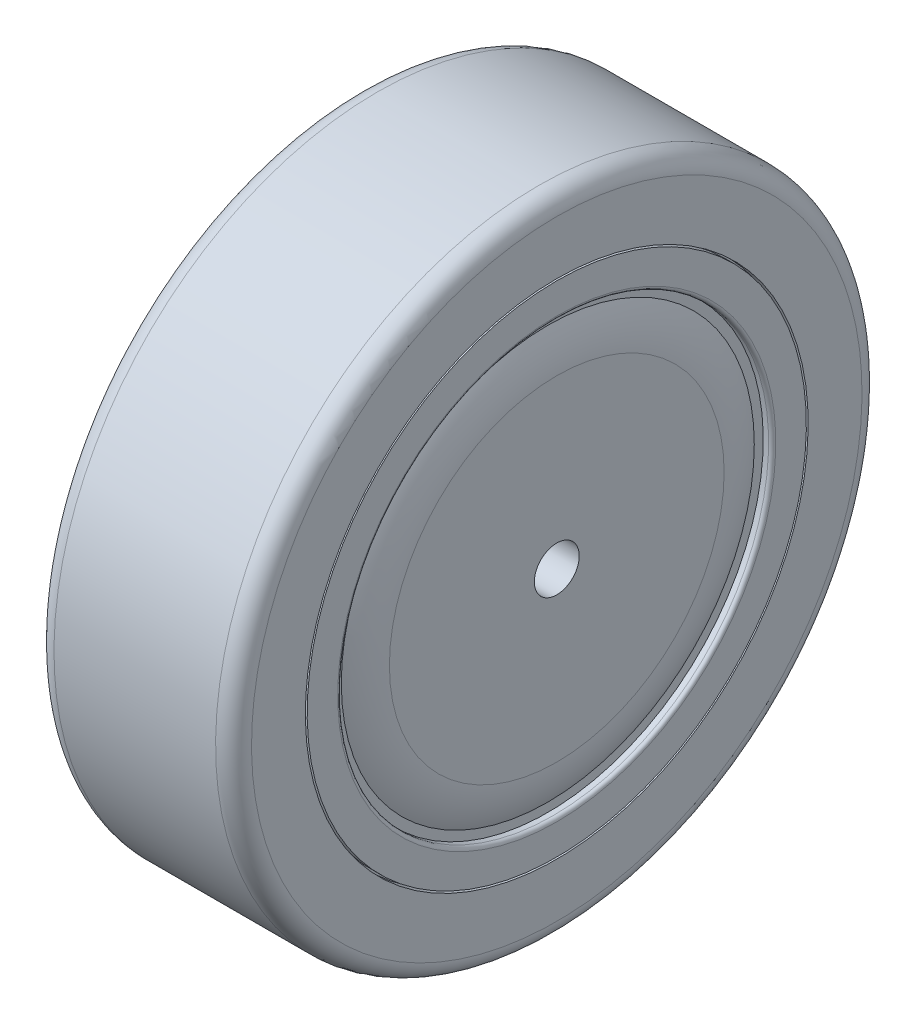
ISO-10303-21;
HEADER;
FILE_DESCRIPTION(('STEP AP214'),'2;1');
FILE_NAME('part.step','',(''),(''),'','','');
FILE_SCHEMA(('AUTOMOTIVE_DESIGN { 1 0 10303 214 1 1 1 1 }'));
ENDSEC;
DATA;
#1=APPLICATION_CONTEXT('core data for automotive mechanical design processes');
#2=APPLICATION_PROTOCOL_DEFINITION('international standard','automotive_design',2000,#1);
#3=PRODUCT_CONTEXT('',#1,'mechanical');
#4=PRODUCT('Part','Part','',(#3));
#5=PRODUCT_RELATED_PRODUCT_CATEGORY('part','',(#4));
#6=PRODUCT_DEFINITION_FORMATION('','',#4);
#7=PRODUCT_DEFINITION_CONTEXT('part definition',#1,'design');
#8=PRODUCT_DEFINITION('design','',#6,#7);
#9=PRODUCT_DEFINITION_SHAPE('','',#8);
#10=(LENGTH_UNIT() NAMED_UNIT(*) SI_UNIT(.MILLI.,.METRE.));
#11=(NAMED_UNIT(*) PLANE_ANGLE_UNIT() SI_UNIT($,.RADIAN.));
#12=(NAMED_UNIT(*) SI_UNIT($,.STERADIAN.) SOLID_ANGLE_UNIT());
#13=UNCERTAINTY_MEASURE_WITH_UNIT(LENGTH_MEASURE(1.E-05),#10,'distance_accuracy_value','');
#14=(GEOMETRIC_REPRESENTATION_CONTEXT(3) GLOBAL_UNCERTAINTY_ASSIGNED_CONTEXT((#13)) GLOBAL_UNIT_ASSIGNED_CONTEXT((#10,
#11,#12)) REPRESENTATION_CONTEXT('',''));
#15=CARTESIAN_POINT('',(0.,0.,0.));
#16=DIRECTION('',(0.,0.,1.));
#17=DIRECTION('',(1.,0.,0.));
#18=AXIS2_PLACEMENT_3D('',#15,#16,#17);
#19=CARTESIAN_POINT('',(11.,-23.,0.));
#20=DIRECTION('',(-1.,0.,0.));
#21=DIRECTION('',(0.,-1.,0.));
#22=AXIS2_PLACEMENT_3D('',#19,#20,#21);
#23=PLANE('',#22);
#24=CARTESIAN_POINT('',(11.,0.,0.));
#25=DIRECTION('',(-1.,0.,0.));
#26=DIRECTION('',(0.,-1.,0.));
#27=AXIS2_PLACEMENT_3D('',#24,#25,#26);
#28=CIRCLE('',#27,18.6411010564593);
#29=CARTESIAN_POINT('',(11.,-18.6411010564593,0.));
#30=VERTEX_POINT('',#29);
#31=EDGE_CURVE('E67',#30,#30,#28,.F.);
#32=ORIENTED_EDGE('',*,*,#31,.T.);
#33=EDGE_LOOP('',(#32));
#34=FACE_BOUND('',#33,.T.);
#35=CARTESIAN_POINT('',(11.,0.,0.));
#36=DIRECTION('',(-1.,0.,0.));
#37=DIRECTION('',(0.,0.,1.));
#38=AXIS2_PLACEMENT_3D('',#35,#36,#37);
#39=CIRCLE('',#38,2.5);
#40=CARTESIAN_POINT('',(11.,0.,2.5));
#41=VERTEX_POINT('',#40);
#42=EDGE_CURVE('E135',#41,#41,#39,.T.);
#43=ORIENTED_EDGE('',*,*,#42,.T.);
#44=EDGE_LOOP('',(#43));
#45=FACE_BOUND('',#44,.T.);
#46=ADVANCED_FACE('F39',(#34,#45),#23,.F.);
#47=CARTESIAN_POINT('',(-11.,-23.,0.));
#48=DIRECTION('',(1.,0.,0.));
#49=DIRECTION('',(0.,1.,0.));
#50=AXIS2_PLACEMENT_3D('',#47,#48,#49);
#51=PLANE('',#50);
#52=CARTESIAN_POINT('',(-11.,0.,0.));
#53=DIRECTION('',(1.,0.,0.));
#54=DIRECTION('',(0.,1.,0.));
#55=AXIS2_PLACEMENT_3D('',#52,#53,#54);
#56=CIRCLE('',#55,18.6411010564593);
#57=CARTESIAN_POINT('',(-11.,18.6411010564593,0.));
#58=VERTEX_POINT('',#57);
#59=EDGE_CURVE('E63',#58,#58,#56,.F.);
#60=ORIENTED_EDGE('',*,*,#59,.T.);
#61=EDGE_LOOP('',(#60));
#62=FACE_BOUND('',#61,.T.);
#63=CARTESIAN_POINT('',(-11.,0.,0.));
#64=DIRECTION('',(-1.,0.,0.));
#65=DIRECTION('',(0.,0.,1.));
#66=AXIS2_PLACEMENT_3D('',#63,#64,#65);
#67=CIRCLE('',#66,2.5);
#68=CARTESIAN_POINT('',(-11.,0.,2.5));
#69=VERTEX_POINT('',#68);
#70=EDGE_CURVE('E139',#69,#69,#67,.T.);
#71=ORIENTED_EDGE('',*,*,#70,.F.);
#72=EDGE_LOOP('',(#71));
#73=FACE_BOUND('',#72,.T.);
#74=ADVANCED_FACE('F146',(#62,#73),#51,.F.);
#75=CARTESIAN_POINT('',(-9.99999999999999,-24.,0.));
#76=DIRECTION('',(1.,0.,0.));
#77=DIRECTION('',(0.,1.,0.));
#78=AXIS2_PLACEMENT_3D('',#75,#76,#77);
#79=PLANE('',#78);
#80=CARTESIAN_POINT('',(-10.,0.,0.));
#81=DIRECTION('',(1.,0.,0.));
#82=DIRECTION('',(0.,1.,0.));
#83=AXIS2_PLACEMENT_3D('',#80,#81,#82);
#84=CIRCLE('',#83,24.);
#85=CARTESIAN_POINT('',(-10.,24.,0.));
#86=VERTEX_POINT('',#85);
#87=EDGE_CURVE('E75',#86,#86,#84,.T.);
#88=ORIENTED_EDGE('',*,*,#87,.F.);
#89=EDGE_LOOP('',(#88));
#90=FACE_BOUND('',#89,.T.);
#91=CARTESIAN_POINT('',(-10.,0.,0.));
#92=DIRECTION('',(1.,0.,0.));
#93=DIRECTION('',(0.,1.,0.));
#94=AXIS2_PLACEMENT_3D('',#91,#92,#93);
#95=CIRCLE('',#94,23.);
#96=CARTESIAN_POINT('',(-10.,23.,0.));
#97=VERTEX_POINT('',#96);
#98=EDGE_CURVE('E71',#97,#97,#95,.T.);
#99=ORIENTED_EDGE('',*,*,#98,.T.);
#100=EDGE_LOOP('',(#99));
#101=FACE_BOUND('',#100,.T.);
#102=ADVANCED_FACE('F148',(#90,#101),#79,.F.);
#103=CARTESIAN_POINT('',(11.,0.,0.));
#104=DIRECTION('',(1.,0.,0.));
#105=DIRECTION('',(0.,1.,0.));
#106=AXIS2_PLACEMENT_3D('',#103,#104,#105);
#107=CYLINDRICAL_SURFACE('',#106,24.);
#108=CARTESIAN_POINT('',(-10.6,0.,0.));
#109=DIRECTION('',(1.,0.,0.));
#110=DIRECTION('',(0.,1.,0.));
#111=AXIS2_PLACEMENT_3D('',#108,#109,#110);
#112=CIRCLE('',#111,24.);
#113=CARTESIAN_POINT('',(-10.6,24.,0.));
#114=VERTEX_POINT('',#113);
#115=EDGE_CURVE('E10',#114,#114,#112,.F.);
#116=ORIENTED_EDGE('',*,*,#115,.T.);
#117=EDGE_LOOP('',(#116));
#118=FACE_BOUND('',#117,.T.);
#119=ORIENTED_EDGE('',*,*,#87,.T.);
#120=EDGE_LOOP('',(#119));
#121=FACE_BOUND('',#120,.T.);
#122=ADVANCED_FACE('F155',(#118,#121),#107,.F.);
#123=CARTESIAN_POINT('',(-11.,-27.8,0.));
#124=DIRECTION('',(1.,0.,0.));
#125=DIRECTION('',(0.,1.,0.));
#126=AXIS2_PLACEMENT_3D('',#123,#124,#125);
#127=PLANE('',#126);
#128=CARTESIAN_POINT('',(-11.,0.,0.));
#129=DIRECTION('',(1.,0.,0.));
#130=DIRECTION('',(0.,1.,0.));
#131=AXIS2_PLACEMENT_3D('',#128,#129,#130);
#132=CIRCLE('',#131,24.4);
#133=CARTESIAN_POINT('',(-11.,24.4,0.));
#134=VERTEX_POINT('',#133);
#135=EDGE_CURVE('E47',#134,#134,#132,.T.);
#136=ORIENTED_EDGE('',*,*,#135,.T.);
#137=EDGE_LOOP('',(#136));
#138=FACE_BOUND('',#137,.T.);
#139=CARTESIAN_POINT('',(-11.,0.,0.));
#140=DIRECTION('',(1.,0.,0.));
#141=DIRECTION('',(0.,1.,0.));
#142=AXIS2_PLACEMENT_3D('',#139,#140,#141);
#143=CIRCLE('',#142,27.8);
#144=CARTESIAN_POINT('',(-11.,27.8,0.));
#145=VERTEX_POINT('',#144);
#146=EDGE_CURVE('E79',#145,#145,#143,.T.);
#147=ORIENTED_EDGE('',*,*,#146,.F.);
#148=EDGE_LOOP('',(#147));
#149=FACE_BOUND('',#148,.T.);
#150=ADVANCED_FACE('F244',(#138,#149),#127,.F.);
#151=CARTESIAN_POINT('',(11.,0.,0.));
#152=DIRECTION('',(1.,0.,0.));
#153=DIRECTION('',(0.,1.,0.));
#154=AXIS2_PLACEMENT_3D('',#151,#152,#153);
#155=CYLINDRICAL_SURFACE('',#154,27.8);
#156=CARTESIAN_POINT('',(-10.,0.,0.));
#157=DIRECTION('',(1.,0.,0.));
#158=DIRECTION('',(0.,1.,0.));
#159=AXIS2_PLACEMENT_3D('',#156,#157,#158);
#160=CIRCLE('',#159,27.8);
#161=CARTESIAN_POINT('',(-10.,27.8,0.));
#162=VERTEX_POINT('',#161);
#163=EDGE_CURVE('E83',#162,#162,#160,.T.);
#164=ORIENTED_EDGE('',*,*,#163,.F.);
#165=EDGE_LOOP('',(#164));
#166=FACE_BOUND('',#165,.T.);
#167=ORIENTED_EDGE('',*,*,#146,.T.);
#168=EDGE_LOOP('',(#167));
#169=FACE_BOUND('',#168,.T.);
#170=ADVANCED_FACE('F240',(#166,#169),#155,.T.);
#171=CARTESIAN_POINT('',(-9.99999999999999,-28.,0.));
#172=DIRECTION('',(1.,0.,0.));
#173=DIRECTION('',(0.,1.,0.));
#174=AXIS2_PLACEMENT_3D('',#171,#172,#173);
#175=PLANE('',#174);
#176=CARTESIAN_POINT('',(-10.,0.,0.));
#177=DIRECTION('',(1.,0.,0.));
#178=DIRECTION('',(0.,1.,0.));
#179=AXIS2_PLACEMENT_3D('',#176,#177,#178);
#180=CIRCLE('',#179,28.);
#181=CARTESIAN_POINT('',(-10.,28.,0.));
#182=VERTEX_POINT('',#181);
#183=EDGE_CURVE('E87',#182,#182,#180,.T.);
#184=ORIENTED_EDGE('',*,*,#183,.F.);
#185=EDGE_LOOP('',(#184));
#186=FACE_BOUND('',#185,.T.);
#187=ORIENTED_EDGE('',*,*,#163,.T.);
#188=EDGE_LOOP('',(#187));
#189=FACE_BOUND('',#188,.T.);
#190=ADVANCED_FACE('F236',(#186,#189),#175,.F.);
#191=CARTESIAN_POINT('',(11.,0.,0.));
#192=DIRECTION('',(1.,0.,0.));
#193=DIRECTION('',(0.,1.,0.));
#194=AXIS2_PLACEMENT_3D('',#191,#192,#193);
#195=CYLINDRICAL_SURFACE('',#194,28.);
#196=CARTESIAN_POINT('',(-11.,0.,0.));
#197=DIRECTION('',(1.,0.,0.));
#198=DIRECTION('',(0.,1.,0.));
#199=AXIS2_PLACEMENT_3D('',#196,#197,#198);
#200=CIRCLE('',#199,28.);
#201=CARTESIAN_POINT('',(-11.,28.,0.));
#202=VERTEX_POINT('',#201);
#203=EDGE_CURVE('E91',#202,#202,#200,.T.);
#204=ORIENTED_EDGE('',*,*,#203,.F.);
#205=EDGE_LOOP('',(#204));
#206=FACE_BOUND('',#205,.T.);
#207=ORIENTED_EDGE('',*,*,#183,.T.);
#208=EDGE_LOOP('',(#207));
#209=FACE_BOUND('',#208,.T.);
#210=ADVANCED_FACE('F232',(#206,#209),#195,.F.);
#211=CARTESIAN_POINT('',(-11.,-34.,0.));
#212=DIRECTION('',(1.,0.,0.));
#213=DIRECTION('',(0.,1.,0.));
#214=AXIS2_PLACEMENT_3D('',#211,#212,#213);
#215=PLANE('',#214);
#216=CARTESIAN_POINT('',(-11.,0.,0.));
#217=DIRECTION('',(1.,0.,0.));
#218=DIRECTION('',(0.,1.,0.));
#219=AXIS2_PLACEMENT_3D('',#216,#217,#218);
#220=CIRCLE('',#219,34.);
#221=CARTESIAN_POINT('',(-11.,34.,0.));
#222=VERTEX_POINT('',#221);
#223=EDGE_CURVE('E95',#222,#222,#220,.T.);
#224=ORIENTED_EDGE('',*,*,#223,.F.);
#225=EDGE_LOOP('',(#224));
#226=FACE_BOUND('',#225,.T.);
#227=ORIENTED_EDGE('',*,*,#203,.T.);
#228=EDGE_LOOP('',(#227));
#229=FACE_BOUND('',#228,.T.);
#230=ADVANCED_FACE('F228',(#226,#229),#215,.F.);
#231=CARTESIAN_POINT('',(-9.,0.,0.));
#232=DIRECTION('',(1.,0.,0.));
#233=DIRECTION('',(0.,1.,0.));
#234=AXIS2_PLACEMENT_3D('',#231,#232,#233);
#235=TOROIDAL_SURFACE('',#234,34.,2.);
#236=CARTESIAN_POINT('',(-9.,0.,0.));
#237=DIRECTION('',(1.,0.,0.));
#238=DIRECTION('',(0.,1.,0.));
#239=AXIS2_PLACEMENT_3D('',#236,#237,#238);
#240=CIRCLE('',#239,36.);
#241=CARTESIAN_POINT('',(-9.,36.,0.));
#242=VERTEX_POINT('',#241);
#243=EDGE_CURVE('E99',#242,#242,#240,.T.);
#244=ORIENTED_EDGE('',*,*,#243,.F.);
#245=EDGE_LOOP('',(#244));
#246=FACE_BOUND('',#245,.T.);
#247=ORIENTED_EDGE('',*,*,#223,.T.);
#248=EDGE_LOOP('',(#247));
#249=FACE_BOUND('',#248,.T.);
#250=ADVANCED_FACE('F224',(#246,#249),#235,.T.);
#251=CARTESIAN_POINT('',(11.,0.,0.));
#252=DIRECTION('',(1.,0.,0.));
#253=DIRECTION('',(0.,1.,0.));
#254=AXIS2_PLACEMENT_3D('',#251,#252,#253);
#255=CYLINDRICAL_SURFACE('',#254,36.);
#256=CARTESIAN_POINT('',(9.,0.,0.));
#257=DIRECTION('',(1.,0.,0.));
#258=DIRECTION('',(0.,1.,0.));
#259=AXIS2_PLACEMENT_3D('',#256,#257,#258);
#260=CIRCLE('',#259,36.);
#261=CARTESIAN_POINT('',(8.99999999999999,36.,0.));
#262=VERTEX_POINT('',#261);
#263=EDGE_CURVE('E103',#262,#262,#260,.T.);
#264=ORIENTED_EDGE('',*,*,#263,.F.);
#265=EDGE_LOOP('',(#264));
#266=FACE_BOUND('',#265,.T.);
#267=ORIENTED_EDGE('',*,*,#243,.T.);
#268=EDGE_LOOP('',(#267));
#269=FACE_BOUND('',#268,.T.);
#270=ADVANCED_FACE('F220',(#266,#269),#255,.T.);
#271=CARTESIAN_POINT('',(9.,0.,0.));
#272=DIRECTION('',(1.,0.,0.));
#273=DIRECTION('',(0.,1.,0.));
#274=AXIS2_PLACEMENT_3D('',#271,#272,#273);
#275=TOROIDAL_SURFACE('',#274,34.,2.);
#276=CARTESIAN_POINT('',(11.,0.,0.));
#277=DIRECTION('',(1.,0.,0.));
#278=DIRECTION('',(0.,1.,0.));
#279=AXIS2_PLACEMENT_3D('',#276,#277,#278);
#280=CIRCLE('',#279,34.);
#281=CARTESIAN_POINT('',(11.,34.,0.));
#282=VERTEX_POINT('',#281);
#283=EDGE_CURVE('E107',#282,#282,#280,.T.);
#284=ORIENTED_EDGE('',*,*,#283,.F.);
#285=EDGE_LOOP('',(#284));
#286=FACE_BOUND('',#285,.T.);
#287=ORIENTED_EDGE('',*,*,#263,.T.);
#288=EDGE_LOOP('',(#287));
#289=FACE_BOUND('',#288,.T.);
#290=ADVANCED_FACE('F216',(#286,#289),#275,.T.);
#291=CARTESIAN_POINT('',(11.,-34.,0.));
#292=DIRECTION('',(-1.,0.,0.));
#293=DIRECTION('',(0.,-1.,0.));
#294=AXIS2_PLACEMENT_3D('',#291,#292,#293);
#295=PLANE('',#294);
#296=CARTESIAN_POINT('',(11.,0.,0.));
#297=DIRECTION('',(1.,0.,0.));
#298=DIRECTION('',(0.,1.,0.));
#299=AXIS2_PLACEMENT_3D('',#296,#297,#298);
#300=CIRCLE('',#299,28.);
#301=CARTESIAN_POINT('',(11.,28.,0.));
#302=VERTEX_POINT('',#301);
#303=EDGE_CURVE('E111',#302,#302,#300,.T.);
#304=ORIENTED_EDGE('',*,*,#303,.F.);
#305=EDGE_LOOP('',(#304));
#306=FACE_BOUND('',#305,.T.);
#307=ORIENTED_EDGE('',*,*,#283,.T.);
#308=EDGE_LOOP('',(#307));
#309=FACE_BOUND('',#308,.T.);
#310=ADVANCED_FACE('F212',(#306,#309),#295,.F.);
#311=CARTESIAN_POINT('',(11.,0.,0.));
#312=DIRECTION('',(1.,0.,0.));
#313=DIRECTION('',(0.,1.,0.));
#314=AXIS2_PLACEMENT_3D('',#311,#312,#313);
#315=CYLINDRICAL_SURFACE('',#314,28.);
#316=CARTESIAN_POINT('',(10.,0.,0.));
#317=DIRECTION('',(1.,0.,0.));
#318=DIRECTION('',(0.,1.,0.));
#319=AXIS2_PLACEMENT_3D('',#316,#317,#318);
#320=CIRCLE('',#319,28.);
#321=CARTESIAN_POINT('',(10.,28.,0.));
#322=VERTEX_POINT('',#321);
#323=EDGE_CURVE('E115',#322,#322,#320,.T.);
#324=ORIENTED_EDGE('',*,*,#323,.F.);
#325=EDGE_LOOP('',(#324));
#326=FACE_BOUND('',#325,.T.);
#327=ORIENTED_EDGE('',*,*,#303,.T.);
#328=EDGE_LOOP('',(#327));
#329=FACE_BOUND('',#328,.T.);
#330=ADVANCED_FACE('F208',(#326,#329),#315,.F.);
#331=CARTESIAN_POINT('',(10.,-28.,0.));
#332=DIRECTION('',(-1.,0.,0.));
#333=DIRECTION('',(0.,-1.,0.));
#334=AXIS2_PLACEMENT_3D('',#331,#332,#333);
#335=PLANE('',#334);
#336=CARTESIAN_POINT('',(10.,0.,0.));
#337=DIRECTION('',(1.,0.,0.));
#338=DIRECTION('',(0.,1.,0.));
#339=AXIS2_PLACEMENT_3D('',#336,#337,#338);
#340=CIRCLE('',#339,27.8);
#341=CARTESIAN_POINT('',(9.99999999999999,27.8,0.));
#342=VERTEX_POINT('',#341);
#343=EDGE_CURVE('E119',#342,#342,#340,.T.);
#344=ORIENTED_EDGE('',*,*,#343,.F.);
#345=EDGE_LOOP('',(#344));
#346=FACE_BOUND('',#345,.T.);
#347=ORIENTED_EDGE('',*,*,#323,.T.);
#348=EDGE_LOOP('',(#347));
#349=FACE_BOUND('',#348,.T.);
#350=ADVANCED_FACE('F204',(#346,#349),#335,.F.);
#351=CARTESIAN_POINT('',(11.,0.,0.));
#352=DIRECTION('',(1.,0.,0.));
#353=DIRECTION('',(0.,1.,0.));
#354=AXIS2_PLACEMENT_3D('',#351,#352,#353);
#355=CYLINDRICAL_SURFACE('',#354,27.8);
#356=CARTESIAN_POINT('',(11.,0.,0.));
#357=DIRECTION('',(1.,0.,0.));
#358=DIRECTION('',(0.,1.,0.));
#359=AXIS2_PLACEMENT_3D('',#356,#357,#358);
#360=CIRCLE('',#359,27.8);
#361=CARTESIAN_POINT('',(11.,27.8,0.));
#362=VERTEX_POINT('',#361);
#363=EDGE_CURVE('E123',#362,#362,#360,.T.);
#364=ORIENTED_EDGE('',*,*,#363,.F.);
#365=EDGE_LOOP('',(#364));
#366=FACE_BOUND('',#365,.T.);
#367=ORIENTED_EDGE('',*,*,#343,.T.);
#368=EDGE_LOOP('',(#367));
#369=FACE_BOUND('',#368,.T.);
#370=ADVANCED_FACE('F200',(#366,#369),#355,.T.);
#371=CARTESIAN_POINT('',(11.,-27.8,0.));
#372=DIRECTION('',(-1.,0.,0.));
#373=DIRECTION('',(0.,-1.,0.));
#374=AXIS2_PLACEMENT_3D('',#371,#372,#373);
#375=PLANE('',#374);
#376=CARTESIAN_POINT('',(11.,0.,0.));
#377=DIRECTION('',(-1.,0.,0.));
#378=DIRECTION('',(0.,-1.,0.));
#379=AXIS2_PLACEMENT_3D('',#376,#377,#378);
#380=CIRCLE('',#379,24.4);
#381=CARTESIAN_POINT('',(11.,-24.4,0.));
#382=VERTEX_POINT('',#381);
#383=EDGE_CURVE('E52',#382,#382,#380,.T.);
#384=ORIENTED_EDGE('',*,*,#383,.T.);
#385=EDGE_LOOP('',(#384));
#386=FACE_BOUND('',#385,.T.);
#387=ORIENTED_EDGE('',*,*,#363,.T.);
#388=EDGE_LOOP('',(#387));
#389=FACE_BOUND('',#388,.T.);
#390=ADVANCED_FACE('F184',(#386,#389),#375,.F.);
#391=CARTESIAN_POINT('',(11.,0.,0.));
#392=DIRECTION('',(1.,0.,0.));
#393=DIRECTION('',(0.,1.,0.));
#394=AXIS2_PLACEMENT_3D('',#391,#392,#393);
#395=CYLINDRICAL_SURFACE('',#394,24.);
#396=CARTESIAN_POINT('',(10.6,0.,0.));
#397=DIRECTION('',(-1.,0.,0.));
#398=DIRECTION('',(0.,-1.,0.));
#399=AXIS2_PLACEMENT_3D('',#396,#397,#398);
#400=CIRCLE('',#399,24.);
#401=CARTESIAN_POINT('',(10.6,-24.,0.));
#402=VERTEX_POINT('',#401);
#403=EDGE_CURVE('E57',#402,#402,#400,.F.);
#404=ORIENTED_EDGE('',*,*,#403,.T.);
#405=EDGE_LOOP('',(#404));
#406=FACE_BOUND('',#405,.T.);
#407=CARTESIAN_POINT('',(10.,0.,0.));
#408=DIRECTION('',(1.,0.,0.));
#409=DIRECTION('',(0.,1.,0.));
#410=AXIS2_PLACEMENT_3D('',#407,#408,#409);
#411=CIRCLE('',#410,24.);
#412=CARTESIAN_POINT('',(9.99999999999999,24.,0.));
#413=VERTEX_POINT('',#412);
#414=EDGE_CURVE('E127',#413,#413,#411,.T.);
#415=ORIENTED_EDGE('',*,*,#414,.F.);
#416=EDGE_LOOP('',(#415));
#417=FACE_BOUND('',#416,.T.);
#418=ADVANCED_FACE('F180',(#406,#417),#395,.F.);
#419=CARTESIAN_POINT('',(10.,-24.,0.));
#420=DIRECTION('',(-1.,0.,0.));
#421=DIRECTION('',(0.,-1.,0.));
#422=AXIS2_PLACEMENT_3D('',#419,#420,#421);
#423=PLANE('',#422);
#424=CARTESIAN_POINT('',(10.,0.,0.));
#425=DIRECTION('',(1.,0.,0.));
#426=DIRECTION('',(0.,1.,0.));
#427=AXIS2_PLACEMENT_3D('',#424,#425,#426);
#428=CIRCLE('',#427,23.);
#429=CARTESIAN_POINT('',(10.,23.,0.));
#430=VERTEX_POINT('',#429);
#431=EDGE_CURVE('E131',#430,#430,#428,.T.);
#432=ORIENTED_EDGE('',*,*,#431,.F.);
#433=EDGE_LOOP('',(#432));
#434=FACE_BOUND('',#433,.T.);
#435=ORIENTED_EDGE('',*,*,#414,.T.);
#436=EDGE_LOOP('',(#435));
#437=FACE_BOUND('',#436,.T.);
#438=ADVANCED_FACE('F183',(#434,#437),#423,.F.);
#439=CARTESIAN_POINT('',(11.,0.,0.));
#440=DIRECTION('',(-1.,0.,0.));
#441=DIRECTION('',(0.,0.,1.));
#442=AXIS2_PLACEMENT_3D('',#439,#440,#441);
#443=CYLINDRICAL_SURFACE('',#442,2.5);
#444=ORIENTED_EDGE('',*,*,#42,.F.);
#445=EDGE_LOOP('',(#444));
#446=FACE_BOUND('',#445,.T.);
#447=ORIENTED_EDGE('',*,*,#70,.T.);
#448=EDGE_LOOP('',(#447));
#449=FACE_BOUND('',#448,.T.);
#450=ADVANCED_FACE('F144',(#446,#449),#443,.F.);
#451=CARTESIAN_POINT('',(1.,0.,0.));
#452=DIRECTION('',(1.,0.,0.));
#453=DIRECTION('',(0.,1.,0.));
#454=AXIS2_PLACEMENT_3D('',#451,#452,#453);
#455=TOROIDAL_SURFACE('',#454,18.6411010564593,10.);
#456=ORIENTED_EDGE('',*,*,#431,.T.);
#457=EDGE_LOOP('',(#456));
#458=FACE_BOUND('',#457,.T.);
#459=ORIENTED_EDGE('',*,*,#31,.F.);
#460=EDGE_LOOP('',(#459));
#461=FACE_BOUND('',#460,.T.);
#462=ADVANCED_FACE('F162',(#458,#461),#455,.T.);
#463=CARTESIAN_POINT('',(-1.,0.,0.));
#464=DIRECTION('',(-1.,0.,0.));
#465=DIRECTION('',(0.,-1.,0.));
#466=AXIS2_PLACEMENT_3D('',#463,#464,#465);
#467=TOROIDAL_SURFACE('',#466,18.6411010564593,10.);
#468=ORIENTED_EDGE('',*,*,#59,.F.);
#469=EDGE_LOOP('',(#468));
#470=FACE_BOUND('',#469,.T.);
#471=ORIENTED_EDGE('',*,*,#98,.F.);
#472=EDGE_LOOP('',(#471));
#473=FACE_BOUND('',#472,.T.);
#474=ADVANCED_FACE('F165',(#470,#473),#467,.T.);
#475=CARTESIAN_POINT('',(10.6,0.,0.));
#476=DIRECTION('',(-1.,0.,0.));
#477=DIRECTION('',(0.,-1.,0.));
#478=AXIS2_PLACEMENT_3D('',#475,#476,#477);
#479=TOROIDAL_SURFACE('',#478,24.4,0.4);
#480=ORIENTED_EDGE('',*,*,#383,.F.);
#481=EDGE_LOOP('',(#480));
#482=FACE_BOUND('',#481,.T.);
#483=ORIENTED_EDGE('',*,*,#403,.F.);
#484=EDGE_LOOP('',(#483));
#485=FACE_BOUND('',#484,.T.);
#486=ADVANCED_FACE('F168',(#482,#485),#479,.T.);
#487=CARTESIAN_POINT('',(-10.6,0.,0.));
#488=DIRECTION('',(1.,0.,0.));
#489=DIRECTION('',(0.,1.,0.));
#490=AXIS2_PLACEMENT_3D('',#487,#488,#489);
#491=TOROIDAL_SURFACE('',#490,24.4,0.4);
#492=ORIENTED_EDGE('',*,*,#115,.F.);
#493=EDGE_LOOP('',(#492));
#494=FACE_BOUND('',#493,.T.);
#495=ORIENTED_EDGE('',*,*,#135,.F.);
#496=EDGE_LOOP('',(#495));
#497=FACE_BOUND('',#496,.T.);
#498=ADVANCED_FACE('F41',(#494,#497),#491,.T.);
#499=CLOSED_SHELL('',(#46,#74,#102,#122,#150,#170,#190,#210,#230,#250,#270,#290,#310,#330,#350,
#370,#390,#418,#438,#450,#462,#474,#486,#498));
#500=MANIFOLD_SOLID_BREP('B2',#499);
#501=ADVANCED_BREP_SHAPE_REPRESENTATION('',(#18,#500),#14);
#502=SHAPE_DEFINITION_REPRESENTATION(#9,#501);
ENDSEC;
END-ISO-10303-21;
